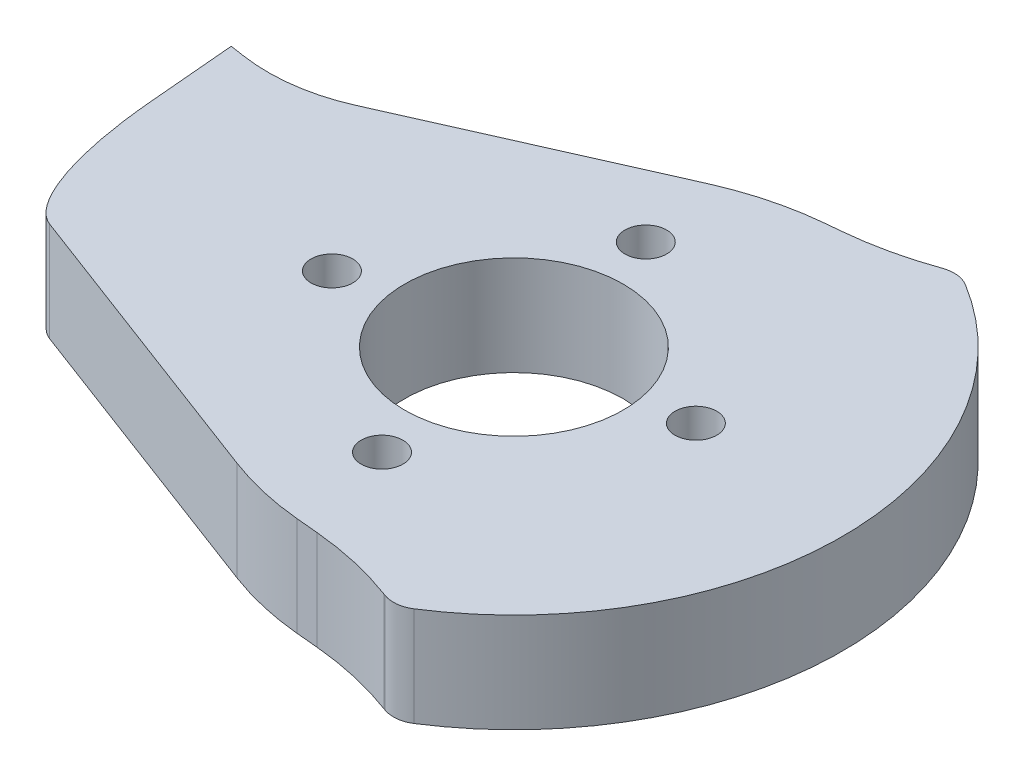
ISO-10303-21;
HEADER;
FILE_DESCRIPTION(('STEP AP214'),'2;1');
FILE_NAME('part.step','',(''),(''),'','','');
FILE_SCHEMA(('AUTOMOTIVE_DESIGN { 1 0 10303 214 1 1 1 1 }'));
ENDSEC;
DATA;
#1=APPLICATION_CONTEXT('core data for automotive mechanical design processes');
#2=APPLICATION_PROTOCOL_DEFINITION('international standard','automotive_design',2000,#1);
#3=PRODUCT_CONTEXT('',#1,'mechanical');
#4=PRODUCT('Part','Part','',(#3));
#5=PRODUCT_RELATED_PRODUCT_CATEGORY('part','',(#4));
#6=PRODUCT_DEFINITION_FORMATION('','',#4);
#7=PRODUCT_DEFINITION_CONTEXT('part definition',#1,'design');
#8=PRODUCT_DEFINITION('design','',#6,#7);
#9=PRODUCT_DEFINITION_SHAPE('','',#8);
#10=(LENGTH_UNIT() NAMED_UNIT(*) SI_UNIT(.MILLI.,.METRE.));
#11=(NAMED_UNIT(*) PLANE_ANGLE_UNIT() SI_UNIT($,.RADIAN.));
#12=(NAMED_UNIT(*) SI_UNIT($,.STERADIAN.) SOLID_ANGLE_UNIT());
#13=UNCERTAINTY_MEASURE_WITH_UNIT(LENGTH_MEASURE(1.E-05),#10,'distance_accuracy_value','');
#14=(GEOMETRIC_REPRESENTATION_CONTEXT(3) GLOBAL_UNCERTAINTY_ASSIGNED_CONTEXT((#13)) GLOBAL_UNIT_ASSIGNED_CONTEXT((#10,
#11,#12)) REPRESENTATION_CONTEXT('',''));
#15=CARTESIAN_POINT('',(0.,0.,0.));
#16=DIRECTION('',(0.,0.,1.));
#17=DIRECTION('',(1.,0.,0.));
#18=AXIS2_PLACEMENT_3D('',#15,#16,#17);
#19=CARTESIAN_POINT('',(-3.38,10.,0.39));
#20=DIRECTION('',(0.,-1.,0.));
#21=DIRECTION('',(0.,0.,-1.));
#22=AXIS2_PLACEMENT_3D('',#19,#20,#21);
#23=PLANE('',#22);
#24=CARTESIAN_POINT('',(12.42,10.,-2.13190404258369));
#25=DIRECTION('',(0.,1.,0.));
#26=DIRECTION('',(0.,0.,1.));
#27=AXIS2_PLACEMENT_3D('',#24,#25,#26);
#28=CIRCLE('',#27,2.1);
#29=CARTESIAN_POINT('',(12.42,10.,-0.0319040425836949));
#30=VERTEX_POINT('',#29);
#31=EDGE_CURVE('E423',#30,#30,#28,.T.);
#32=ORIENTED_EDGE('',*,*,#31,.F.);
#33=EDGE_LOOP('',(#32));
#34=FACE_BOUND('',#33,.T.);
#35=CARTESIAN_POINT('',(-0.858095957416307,10.,16.19));
#36=DIRECTION('',(0.,1.,0.));
#37=DIRECTION('',(0.,0.,1.));
#38=AXIS2_PLACEMENT_3D('',#35,#36,#37);
#39=CIRCLE('',#38,2.09999999999999);
#40=CARTESIAN_POINT('',(-0.858095957416307,10.,18.29));
#41=VERTEX_POINT('',#40);
#42=EDGE_CURVE('E420',#41,#41,#39,.T.);
#43=ORIENTED_EDGE('',*,*,#42,.F.);
#44=EDGE_LOOP('',(#43));
#45=FACE_BOUND('',#44,.T.);
#46=CARTESIAN_POINT('',(-19.18,10.,2.91190404258369));
#47=DIRECTION('',(0.,1.,0.));
#48=DIRECTION('',(0.,0.,1.));
#49=AXIS2_PLACEMENT_3D('',#46,#47,#48);
#50=CIRCLE('',#49,2.1);
#51=CARTESIAN_POINT('',(-19.18,10.,5.01190404258369));
#52=VERTEX_POINT('',#51);
#53=EDGE_CURVE('E414',#52,#52,#50,.T.);
#54=ORIENTED_EDGE('',*,*,#53,.F.);
#55=EDGE_LOOP('',(#54));
#56=FACE_BOUND('',#55,.T.);
#57=CARTESIAN_POINT('',(-5.90190404258369,10.,-15.41));
#58=DIRECTION('',(0.,1.,0.));
#59=DIRECTION('',(0.,0.,1.));
#60=AXIS2_PLACEMENT_3D('',#57,#58,#59);
#61=CIRCLE('',#60,2.1);
#62=CARTESIAN_POINT('',(-5.90190404258369,10.,-13.31));
#63=VERTEX_POINT('',#62);
#64=EDGE_CURVE('E408',#63,#63,#61,.T.);
#65=ORIENTED_EDGE('',*,*,#64,.F.);
#66=EDGE_LOOP('',(#65));
#67=FACE_BOUND('',#66,.T.);
#68=CARTESIAN_POINT('',(-3.38,10.,0.39));
#69=DIRECTION('',(0.,1.,0.));
#70=DIRECTION('',(0.,0.,-1.));
#71=AXIS2_PLACEMENT_3D('',#68,#69,#70);
#72=CIRCLE('',#71,33.05);
#73=CARTESIAN_POINT('',(14.4231109318557,10.,28.235138555016));
#74=VERTEX_POINT('',#73);
#75=CARTESIAN_POINT('',(13.8970744591724,10.,-27.78454876537));
#76=VERTEX_POINT('',#75);
#77=EDGE_CURVE('E671',#74,#76,#72,.T.);
#78=ORIENTED_EDGE('',*,*,#77,.T.);
#79=CARTESIAN_POINT('',(12.328807488597,10.,-25.2271010710853));
#80=DIRECTION('',(0.,-1.,0.));
#81=DIRECTION('',(0.,0.,-1.));
#82=AXIS2_PLACEMENT_3D('',#79,#80,#81);
#83=CIRCLE('',#82,3.);
#84=CARTESIAN_POINT('',(11.3159641886975,10.,-28.0509545463649));
#85=VERTEX_POINT('',#84);
#86=EDGE_CURVE('E50',#76,#85,#83,.F.);
#87=ORIENTED_EDGE('',*,*,#86,.T.);
#88=CARTESIAN_POINT('',(-0.16292654349641,10.,-60.0546272662005));
#89=DIRECTION('',(0.,-1.,0.));
#90=DIRECTION('',(0.,0.,-1.));
#91=AXIS2_PLACEMENT_3D('',#88,#89,#90);
#92=CIRCLE('',#91,34.);
#93=CARTESIAN_POINT('',(2.97875034392076,10.,-26.2000874475135));
#94=VERTEX_POINT('',#93);
#95=EDGE_CURVE('E322',#85,#94,#92,.T.);
#96=ORIENTED_EDGE('',*,*,#95,.T.);
#97=DIRECTION('',(-0.995721759373149,0.,0.0924022613946225));
#98=VECTOR('',#97,1.);
#99=CARTESIAN_POINT('',(7.39594578687549,10.,-26.61));
#100=LINE('',#99,#98);
#101=CARTESIAN_POINT('',(1.51621543901955,10.,-26.0643652627673));
#102=VERTEX_POINT('',#101);
#103=EDGE_CURVE('E675',#94,#102,#100,.T.);
#104=ORIENTED_EDGE('',*,*,#103,.T.);
#105=CARTESIAN_POINT('',(4.28828328085822,10.,3.80728751842721));
#106=DIRECTION('',(0.,-1.,0.));
#107=DIRECTION('',(0.,0.,-1.));
#108=AXIS2_PLACEMENT_3D('',#105,#106,#107);
#109=CIRCLE('',#108,30.);
#110=CARTESIAN_POINT('',(-7.87496371181006,10.,-23.6163413916085));
#111=VERTEX_POINT('',#110);
#112=EDGE_CURVE('E341',#102,#111,#109,.F.);
#113=ORIENTED_EDGE('',*,*,#112,.T.);
#114=DIRECTION('',(-0.914120963667857,0.,0.405441566422276));
#115=VECTOR('',#114,1.);
#116=CARTESIAN_POINT('',(-37.1994590555047,10.,-10.61));
#117=LINE('',#116,#115);
#118=CARTESIAN_POINT('',(-32.4057894577545,10.,-12.7361441186342));
#119=VERTEX_POINT('',#118);
#120=EDGE_CURVE('E169',#111,#119,#117,.T.);
#121=ORIENTED_EDGE('',*,*,#120,.T.);
#122=CARTESIAN_POINT('',(-39.7037376533555,10.,-29.1903214646556));
#123=DIRECTION('',(0.,-1.,0.));
#124=DIRECTION('',(0.,0.,-1.));
#125=AXIS2_PLACEMENT_3D('',#122,#123,#124);
#126=CIRCLE('',#125,18.);
#127=CARTESIAN_POINT('',(-42.3849755981748,10.,-11.3911371270726));
#128=VERTEX_POINT('',#127);
#129=EDGE_CURVE('E164',#119,#128,#126,.T.);
#130=ORIENTED_EDGE('',*,*,#129,.T.);
#131=DIRECTION('',(-0.988843574310169,0.,-0.148957663601072));
#132=VECTOR('',#131,1.);
#133=CARTESIAN_POINT('',(-43.8378793314726,10.,-11.61));
#134=LINE('',#133,#132);
#135=CARTESIAN_POINT('',(-43.8378793314726,10.,-11.61));
#136=VERTEX_POINT('',#135);
#137=EDGE_CURVE('E157',#128,#136,#134,.T.);
#138=ORIENTED_EDGE('',*,*,#137,.T.);
#139=DIRECTION('',(0.0866296163648424,0.,0.996240588195683));
#140=VECTOR('',#139,1.);
#141=CARTESIAN_POINT('',(-43.8378793314726,10.,-11.61));
#142=LINE('',#141,#140);
#143=CARTESIAN_POINT('',(-43.0686600279011,10.,-2.7639780089278));
#144=VERTEX_POINT('',#143);
#145=EDGE_CURVE('E161',#136,#144,#142,.T.);
#146=ORIENTED_EDGE('',*,*,#145,.T.);
#147=CARTESIAN_POINT('',(-37.4640468028692,10.,13.0390917535551));
#148=CARTESIAN_POINT('',(-41.8378793314726,10.,11.39));
#149=CARTESIAN_POINT('',(-43.0686600279011,10.,-2.7639780089278));
#150=(BOUNDED_CURVE() B_SPLINE_CURVE(2,(#147,#148,#149),.UNSPECIFIED.,.F.,
.F.) B_SPLINE_CURVE_WITH_KNOTS((3,3),(0.,1.),
.UNSPECIFIED.) CURVE() GEOMETRIC_REPRESENTATION_ITEM() RATIONAL_B_SPLINE_CURVE((1.,
0.84632326853336,1.)) REPRESENTATION_ITEM(''));
#151=CARTESIAN_POINT('',(-37.4640468028692,10.,13.0390917535551));
#152=VERTEX_POINT('',#151);
#153=EDGE_CURVE('E253',#144,#152,#150,.F.);
#154=ORIENTED_EDGE('',*,*,#153,.T.);
#155=DIRECTION('',(0.935701397714502,0.,0.352792990739793));
#156=VECTOR('',#155,1.);
#157=CARTESIAN_POINT('',(-41.8378793314726,10.,11.39));
#158=LINE('',#157,#156);
#159=CARTESIAN_POINT('',(-7.16448350646626,10.,24.4631139678611));
#160=VERTEX_POINT('',#159);
#161=EDGE_CURVE('E184',#152,#160,#158,.T.);
#162=ORIENTED_EDGE('',*,*,#161,.T.);
#163=CARTESIAN_POINT('',(3.41930621572751,10.,-3.60792796357394));
#164=DIRECTION('',(0.,-1.,0.));
#165=DIRECTION('',(0.,0.,-1.));
#166=AXIS2_PLACEMENT_3D('',#163,#164,#165);
#167=CIRCLE('',#166,30.);
#168=CARTESIAN_POINT('',(0.647238373888836,10.,26.2637248176205));
#169=VERTEX_POINT('',#168);
#170=EDGE_CURVE('E339',#160,#169,#167,.F.);
#171=ORIENTED_EDGE('',*,*,#170,.T.);
#172=DIRECTION('',(0.995721759373149,0.,0.0924022613946225));
#173=VECTOR('',#172,1.);
#174=CARTESIAN_POINT('',(-3.38,10.,25.89));
#175=LINE('',#174,#173);
#176=CARTESIAN_POINT('',(2.88878217623837,10.,26.4717384664159));
#177=VERTEX_POINT('',#176);
#178=EDGE_CURVE('E187',#169,#177,#175,.T.);
#179=ORIENTED_EDGE('',*,*,#178,.T.);
#180=CARTESIAN_POINT('',(-0.2528947111788,10.,60.326278285103));
#181=DIRECTION('',(0.,-1.,0.));
#182=DIRECTION('',(0.,0.,-1.));
#183=AXIS2_PLACEMENT_3D('',#180,#181,#182);
#184=CIRCLE('',#183,34.);
#185=CARTESIAN_POINT('',(11.6366885483879,10.,28.4728984029958));
#186=VERTEX_POINT('',#185);
#187=EDGE_CURVE('E318',#177,#186,#184,.T.);
#188=ORIENTED_EDGE('',*,*,#187,.T.);
#189=DIRECTION('',(0.936864114179623,0.,0.349693625281374));
#190=VECTOR('',#189,1.);
#191=CARTESIAN_POINT('',(7.39594578687549,10.,26.89));
#192=LINE('',#191,#190);
#193=CARTESIAN_POINT('',(11.758013935117,10.,28.5181842813658));
#194=VERTEX_POINT('',#193);
#195=EDGE_CURVE('E688',#186,#194,#192,.T.);
#196=ORIENTED_EDGE('',*,*,#195,.T.);
#197=CARTESIAN_POINT('',(12.8070948109611,10.,25.707591938827));
#198=DIRECTION('',(0.,-1.,0.));
#199=DIRECTION('',(0.,0.,-1.));
#200=AXIS2_PLACEMENT_3D('',#197,#198,#199);
#201=CIRCLE('',#200,3.);
#202=EDGE_CURVE('E306',#194,#74,#201,.F.);
#203=ORIENTED_EDGE('',*,*,#202,.T.);
#204=EDGE_LOOP('',(#78,#87,#96,#104,#113,#121,#130,#138,#146,#154,#162,#171,#179,#188,#196,#203));
#205=FACE_BOUND('',#204,.T.);
#206=CARTESIAN_POINT('',(-3.38,10.,0.39));
#207=DIRECTION('',(0.,1.,0.));
#208=DIRECTION('',(0.,0.,1.));
#209=AXIS2_PLACEMENT_3D('',#206,#207,#208);
#210=CIRCLE('',#209,11.);
#211=CARTESIAN_POINT('',(-3.38,10.,11.39));
#212=VERTEX_POINT('',#211);
#213=EDGE_CURVE('E398',#212,#212,#210,.T.);
#214=ORIENTED_EDGE('',*,*,#213,.F.);
#215=EDGE_LOOP('',(#214));
#216=FACE_BOUND('',#215,.T.);
#217=ADVANCED_FACE('F42',(#34,#45,#56,#67,#205,#216),#23,.F.);
#218=CARTESIAN_POINT('',(-3.38,0.,0.39));
#219=DIRECTION('',(0.,-1.,0.));
#220=DIRECTION('',(0.,0.,-1.));
#221=AXIS2_PLACEMENT_3D('',#218,#219,#220);
#222=PLANE('',#221);
#223=CARTESIAN_POINT('',(12.42,0.,-2.13190404258369));
#224=DIRECTION('',(0.,1.,0.));
#225=DIRECTION('',(0.,0.,1.));
#226=AXIS2_PLACEMENT_3D('',#223,#224,#225);
#227=CIRCLE('',#226,2.1);
#228=CARTESIAN_POINT('',(12.42,0.,-0.0319040425836949));
#229=VERTEX_POINT('',#228);
#230=EDGE_CURVE('E403',#229,#229,#227,.T.);
#231=ORIENTED_EDGE('',*,*,#230,.T.);
#232=EDGE_LOOP('',(#231));
#233=FACE_BOUND('',#232,.T.);
#234=CARTESIAN_POINT('',(-0.858095957416307,0.,16.19));
#235=DIRECTION('',(0.,1.,0.));
#236=DIRECTION('',(0.,0.,1.));
#237=AXIS2_PLACEMENT_3D('',#234,#235,#236);
#238=CIRCLE('',#237,2.09999999999999);
#239=CARTESIAN_POINT('',(-0.858095957416307,0.,18.29));
#240=VERTEX_POINT('',#239);
#241=EDGE_CURVE('E417',#240,#240,#238,.T.);
#242=ORIENTED_EDGE('',*,*,#241,.T.);
#243=EDGE_LOOP('',(#242));
#244=FACE_BOUND('',#243,.T.);
#245=CARTESIAN_POINT('',(-19.18,0.,2.91190404258369));
#246=DIRECTION('',(0.,1.,0.));
#247=DIRECTION('',(0.,0.,1.));
#248=AXIS2_PLACEMENT_3D('',#245,#246,#247);
#249=CIRCLE('',#248,2.1);
#250=CARTESIAN_POINT('',(-19.18,0.,5.01190404258369));
#251=VERTEX_POINT('',#250);
#252=EDGE_CURVE('E411',#251,#251,#249,.T.);
#253=ORIENTED_EDGE('',*,*,#252,.T.);
#254=EDGE_LOOP('',(#253));
#255=FACE_BOUND('',#254,.T.);
#256=CARTESIAN_POINT('',(-5.90190404258369,0.,-15.41));
#257=DIRECTION('',(0.,1.,0.));
#258=DIRECTION('',(0.,0.,1.));
#259=AXIS2_PLACEMENT_3D('',#256,#257,#258);
#260=CIRCLE('',#259,2.1);
#261=CARTESIAN_POINT('',(-5.90190404258369,0.,-13.31));
#262=VERTEX_POINT('',#261);
#263=EDGE_CURVE('E405',#262,#262,#260,.T.);
#264=ORIENTED_EDGE('',*,*,#263,.T.);
#265=EDGE_LOOP('',(#264));
#266=FACE_BOUND('',#265,.T.);
#267=CARTESIAN_POINT('',(-0.16292654349641,0.,-60.0546272662005));
#268=DIRECTION('',(0.,-1.,0.));
#269=DIRECTION('',(0.,0.,-1.));
#270=AXIS2_PLACEMENT_3D('',#267,#268,#269);
#271=CIRCLE('',#270,34.);
#272=CARTESIAN_POINT('',(2.97875034392076,0.,-26.2000874475135));
#273=VERTEX_POINT('',#272);
#274=CARTESIAN_POINT('',(11.3159641886975,0.,-28.0509545463649));
#275=VERTEX_POINT('',#274);
#276=EDGE_CURVE('E324',#273,#275,#271,.F.);
#277=ORIENTED_EDGE('',*,*,#276,.T.);
#278=CARTESIAN_POINT('',(12.328807488597,0.,-25.2271010710853));
#279=DIRECTION('',(0.,-1.,0.));
#280=DIRECTION('',(0.,0.,-1.));
#281=AXIS2_PLACEMENT_3D('',#278,#279,#280);
#282=CIRCLE('',#281,3.);
#283=CARTESIAN_POINT('',(13.8970744591724,0.,-27.78454876537));
#284=VERTEX_POINT('',#283);
#285=EDGE_CURVE('E312',#275,#284,#282,.T.);
#286=ORIENTED_EDGE('',*,*,#285,.T.);
#287=CARTESIAN_POINT('',(-3.38,0.,0.39));
#288=DIRECTION('',(0.,1.,0.));
#289=DIRECTION('',(0.,0.,-1.));
#290=AXIS2_PLACEMENT_3D('',#287,#288,#289);
#291=CIRCLE('',#290,33.05);
#292=CARTESIAN_POINT('',(14.4231109318557,0.,28.235138555016));
#293=VERTEX_POINT('',#292);
#294=EDGE_CURVE('E298',#293,#284,#291,.T.);
#295=ORIENTED_EDGE('',*,*,#294,.F.);
#296=CARTESIAN_POINT('',(12.8070948109611,0.,25.707591938827));
#297=DIRECTION('',(0.,-1.,0.));
#298=DIRECTION('',(0.,0.,-1.));
#299=AXIS2_PLACEMENT_3D('',#296,#297,#298);
#300=CIRCLE('',#299,3.);
#301=CARTESIAN_POINT('',(11.758013935117,0.,28.5181842813658));
#302=VERTEX_POINT('',#301);
#303=EDGE_CURVE('E304',#293,#302,#300,.T.);
#304=ORIENTED_EDGE('',*,*,#303,.T.);
#305=DIRECTION('',(0.936864114179623,0.,0.349693625281374));
#306=VECTOR('',#305,1.);
#307=CARTESIAN_POINT('',(7.39594578687549,0.,26.89));
#308=LINE('',#307,#306);
#309=CARTESIAN_POINT('',(11.6366885483879,0.,28.4728984029958));
#310=VERTEX_POINT('',#309);
#311=EDGE_CURVE('E294',#310,#302,#308,.T.);
#312=ORIENTED_EDGE('',*,*,#311,.F.);
#313=CARTESIAN_POINT('',(-0.2528947111788,0.,60.326278285103));
#314=DIRECTION('',(0.,-1.,0.));
#315=DIRECTION('',(0.,0.,-1.));
#316=AXIS2_PLACEMENT_3D('',#313,#314,#315);
#317=CIRCLE('',#316,34.);
#318=CARTESIAN_POINT('',(2.88878217623837,0.,26.4717384664159));
#319=VERTEX_POINT('',#318);
#320=EDGE_CURVE('E320',#310,#319,#317,.F.);
#321=ORIENTED_EDGE('',*,*,#320,.T.);
#322=DIRECTION('',(0.995721759373149,0.,0.0924022613946225));
#323=VECTOR('',#322,1.);
#324=CARTESIAN_POINT('',(-3.38,0.,25.89));
#325=LINE('',#324,#323);
#326=CARTESIAN_POINT('',(0.647238373888836,0.,26.2637248176205));
#327=VERTEX_POINT('',#326);
#328=EDGE_CURVE('E299',#327,#319,#325,.T.);
#329=ORIENTED_EDGE('',*,*,#328,.F.);
#330=CARTESIAN_POINT('',(3.41930621572751,0.,-3.60792796357394));
#331=DIRECTION('',(0.,-1.,0.));
#332=DIRECTION('',(0.,0.,-1.));
#333=AXIS2_PLACEMENT_3D('',#330,#331,#332);
#334=CIRCLE('',#333,30.);
#335=CARTESIAN_POINT('',(-7.16448350646626,0.,24.4631139678611));
#336=VERTEX_POINT('',#335);
#337=EDGE_CURVE('E345',#327,#336,#334,.T.);
#338=ORIENTED_EDGE('',*,*,#337,.T.);
#339=DIRECTION('',(0.935701397714502,0.,0.352792990739793));
#340=VECTOR('',#339,1.);
#341=CARTESIAN_POINT('',(-41.8378793314726,0.,11.39));
#342=LINE('',#341,#340);
#343=CARTESIAN_POINT('',(-37.4640468028692,0.,13.0390917535551));
#344=VERTEX_POINT('',#343);
#345=EDGE_CURVE('E208',#344,#336,#342,.T.);
#346=ORIENTED_EDGE('',*,*,#345,.F.);
#347=CARTESIAN_POINT('',(-43.0686600279011,0.,-2.7639780089278));
#348=CARTESIAN_POINT('',(-41.8378793314726,0.,11.39));
#349=CARTESIAN_POINT('',(-37.4640468028692,0.,13.0390917535551));
#350=(BOUNDED_CURVE() B_SPLINE_CURVE(2,(#347,#348,#349),.UNSPECIFIED.,.F.,
.F.) B_SPLINE_CURVE_WITH_KNOTS((3,3),(0.,1.),
.UNSPECIFIED.) CURVE() GEOMETRIC_REPRESENTATION_ITEM() RATIONAL_B_SPLINE_CURVE((1.,
0.84632326853336,1.)) REPRESENTATION_ITEM(''));
#351=CARTESIAN_POINT('',(-43.0686600279011,0.,-2.7639780089278));
#352=VERTEX_POINT('',#351);
#353=EDGE_CURVE('E396',#344,#352,#350,.F.);
#354=ORIENTED_EDGE('',*,*,#353,.T.);
#355=DIRECTION('',(0.0866296163648424,0.,0.996240588195683));
#356=VECTOR('',#355,1.);
#357=CARTESIAN_POINT('',(-43.8378793314726,0.,-11.61));
#358=LINE('',#357,#356);
#359=CARTESIAN_POINT('',(-43.8378793314726,0.,-11.61));
#360=VERTEX_POINT('',#359);
#361=EDGE_CURVE('E221',#360,#352,#358,.T.);
#362=ORIENTED_EDGE('',*,*,#361,.F.);
#363=DIRECTION('',(-0.988843574310169,0.,-0.148957663601072));
#364=VECTOR('',#363,1.);
#365=CARTESIAN_POINT('',(-43.8378793314726,0.,-11.61));
#366=LINE('',#365,#364);
#367=CARTESIAN_POINT('',(-42.3849755981748,0.,-11.3911371270726));
#368=VERTEX_POINT('',#367);
#369=EDGE_CURVE('E174',#368,#360,#366,.T.);
#370=ORIENTED_EDGE('',*,*,#369,.F.);
#371=CARTESIAN_POINT('',(-39.7037376533555,0.,-29.1903214646556));
#372=DIRECTION('',(0.,-1.,0.));
#373=DIRECTION('',(0.,0.,-1.));
#374=AXIS2_PLACEMENT_3D('',#371,#372,#373);
#375=CIRCLE('',#374,18.);
#376=CARTESIAN_POINT('',(-32.4057894577545,0.,-12.7361441186342));
#377=VERTEX_POINT('',#376);
#378=EDGE_CURVE('E354',#368,#377,#375,.F.);
#379=ORIENTED_EDGE('',*,*,#378,.T.);
#380=DIRECTION('',(-0.914120963667857,0.,0.405441566422276));
#381=VECTOR('',#380,1.);
#382=CARTESIAN_POINT('',(-37.1994590555047,0.,-10.61));
#383=LINE('',#382,#381);
#384=CARTESIAN_POINT('',(-7.87496371181006,0.,-23.6163413916085));
#385=VERTEX_POINT('',#384);
#386=EDGE_CURVE('E189',#385,#377,#383,.T.);
#387=ORIENTED_EDGE('',*,*,#386,.F.);
#388=CARTESIAN_POINT('',(4.28828328085822,0.,3.80728751842721));
#389=DIRECTION('',(0.,-1.,0.));
#390=DIRECTION('',(0.,0.,-1.));
#391=AXIS2_PLACEMENT_3D('',#388,#389,#390);
#392=CIRCLE('',#391,30.);
#393=CARTESIAN_POINT('',(1.51621543901955,0.,-26.0643652627673));
#394=VERTEX_POINT('',#393);
#395=EDGE_CURVE('E347',#385,#394,#392,.T.);
#396=ORIENTED_EDGE('',*,*,#395,.T.);
#397=DIRECTION('',(-0.995721759373149,0.,0.0924022613946225));
#398=VECTOR('',#397,1.);
#399=CARTESIAN_POINT('',(7.39594578687549,0.,-26.61));
#400=LINE('',#399,#398);
#401=EDGE_CURVE('E674',#273,#394,#400,.T.);
#402=ORIENTED_EDGE('',*,*,#401,.F.);
#403=EDGE_LOOP('',(#277,#286,#295,#304,#312,#321,#329,#338,#346,#354,#362,#370,#379,#387,#396,#402));
#404=FACE_BOUND('',#403,.T.);
#405=CARTESIAN_POINT('',(-3.38,0.,0.39));
#406=DIRECTION('',(0.,1.,0.));
#407=DIRECTION('',(0.,0.,1.));
#408=AXIS2_PLACEMENT_3D('',#405,#406,#407);
#409=CIRCLE('',#408,11.);
#410=CARTESIAN_POINT('',(-3.38,0.,11.39));
#411=VERTEX_POINT('',#410);
#412=EDGE_CURVE('E201',#411,#411,#409,.T.);
#413=ORIENTED_EDGE('',*,*,#412,.T.);
#414=EDGE_LOOP('',(#413));
#415=FACE_BOUND('',#414,.T.);
#416=ADVANCED_FACE('F237',(#233,#244,#255,#266,#404,#415),#222,.T.);
#417=CARTESIAN_POINT('',(-43.8378793314726,10.,-11.61));
#418=DIRECTION('',(0.996240588195683,0.,-0.0866296163648424));
#419=DIRECTION('',(-0.0866296163648424,0.,-0.996240588195683));
#420=AXIS2_PLACEMENT_3D('',#417,#418,#419);
#421=PLANE('',#420);
#422=ORIENTED_EDGE('',*,*,#361,.T.);
#423=CARTESIAN_POINT('',(-43.0686600279011,10.5,-2.7639780089278));
#424=CARTESIAN_POINT('',(-43.0686600279011,6.83333333333332,-2.7639780089278));
#425=CARTESIAN_POINT('',(-43.0686600279011,3.16666666666667,-2.7639780089278));
#426=CARTESIAN_POINT('',(-43.0686600279011,-0.5,-2.7639780089278));
#427=(BOUNDED_CURVE() B_SPLINE_CURVE(3,(#423,#424,#425,#426),.UNSPECIFIED.,.F.,
.F.) B_SPLINE_CURVE_WITH_KNOTS((4,4),(-0.0005,0.0105),
.UNSPECIFIED.) CURVE() GEOMETRIC_REPRESENTATION_ITEM() RATIONAL_B_SPLINE_CURVE((1.,1.,1.,1.)) REPRESENTATION_ITEM(''));
#428=EDGE_CURVE('E182',#352,#144,#427,.F.);
#429=ORIENTED_EDGE('',*,*,#428,.T.);
#430=ORIENTED_EDGE('',*,*,#145,.F.);
#431=DIRECTION('',(0.,-1.,0.));
#432=VECTOR('',#431,1.);
#433=CARTESIAN_POINT('',(-43.8378793314726,10.,-11.61));
#434=LINE('',#433,#432);
#435=EDGE_CURVE('E168',#136,#360,#434,.T.);
#436=ORIENTED_EDGE('',*,*,#435,.T.);
#437=EDGE_LOOP('',(#422,#429,#430,#436));
#438=FACE_BOUND('',#437,.T.);
#439=ADVANCED_FACE('F180',(#438),#421,.F.);
#440=CARTESIAN_POINT('',(-41.8378793314726,10.,11.39));
#441=DIRECTION('',(0.352792990739793,0.,-0.935701397714502));
#442=DIRECTION('',(-0.935701397714502,0.,-0.352792990739793));
#443=AXIS2_PLACEMENT_3D('',#440,#441,#442);
#444=PLANE('',#443);
#445=ORIENTED_EDGE('',*,*,#345,.T.);
#446=DIRECTION('',(0.,-1.,0.));
#447=VECTOR('',#446,1.);
#448=CARTESIAN_POINT('',(-7.16448350646626,10.,24.4631139678611));
#449=LINE('',#448,#447);
#450=EDGE_CURVE('E343',#336,#160,#449,.F.);
#451=ORIENTED_EDGE('',*,*,#450,.T.);
#452=ORIENTED_EDGE('',*,*,#161,.F.);
#453=CARTESIAN_POINT('',(-37.4640468028692,-0.5,13.0390917535551));
#454=CARTESIAN_POINT('',(-37.4640468028692,3.16666666666667,13.0390917535551));
#455=CARTESIAN_POINT('',(-37.4640468028692,6.83333333333332,13.0390917535551));
#456=CARTESIAN_POINT('',(-37.4640468028692,10.5,13.0390917535551));
#457=(BOUNDED_CURVE() B_SPLINE_CURVE(3,(#453,#454,#455,#456),.UNSPECIFIED.,.F.,
.F.) B_SPLINE_CURVE_WITH_KNOTS((4,4),(-0.0005,0.0105),
.UNSPECIFIED.) CURVE() GEOMETRIC_REPRESENTATION_ITEM() RATIONAL_B_SPLINE_CURVE((1.,1.,1.,1.)) REPRESENTATION_ITEM(''));
#458=EDGE_CURVE('E178',#152,#344,#457,.F.);
#459=ORIENTED_EDGE('',*,*,#458,.T.);
#460=EDGE_LOOP('',(#445,#451,#452,#459));
#461=FACE_BOUND('',#460,.T.);
#462=ADVANCED_FACE('F223',(#461),#444,.F.);
#463=CARTESIAN_POINT('',(-3.38,10.,25.89));
#464=DIRECTION('',(0.0924022613946225,0.,-0.995721759373149));
#465=DIRECTION('',(-0.995721759373149,0.,-0.0924022613946225));
#466=AXIS2_PLACEMENT_3D('',#463,#464,#465);
#467=PLANE('',#466);
#468=ORIENTED_EDGE('',*,*,#328,.T.);
#469=DIRECTION('',(0.,-1.,0.));
#470=VECTOR('',#469,1.);
#471=CARTESIAN_POINT('',(2.88878217623837,10.,26.4717384664159));
#472=LINE('',#471,#470);
#473=EDGE_CURVE('E327',#319,#177,#472,.F.);
#474=ORIENTED_EDGE('',*,*,#473,.T.);
#475=ORIENTED_EDGE('',*,*,#178,.F.);
#476=DIRECTION('',(0.,-1.,0.));
#477=VECTOR('',#476,1.);
#478=CARTESIAN_POINT('',(0.647238373888836,10.,26.2637248176205));
#479=LINE('',#478,#477);
#480=EDGE_CURVE('E350',#169,#327,#479,.T.);
#481=ORIENTED_EDGE('',*,*,#480,.T.);
#482=EDGE_LOOP('',(#468,#474,#475,#481));
#483=FACE_BOUND('',#482,.T.);
#484=ADVANCED_FACE('F233',(#483),#467,.F.);
#485=CARTESIAN_POINT('',(7.39594578687549,10.,26.89));
#486=DIRECTION('',(0.349693625281374,0.,-0.936864114179623));
#487=DIRECTION('',(-0.936864114179623,0.,-0.349693625281374));
#488=AXIS2_PLACEMENT_3D('',#485,#486,#487);
#489=PLANE('',#488);
#490=ORIENTED_EDGE('',*,*,#311,.T.);
#491=DIRECTION('',(0.,-1.,0.));
#492=VECTOR('',#491,1.);
#493=CARTESIAN_POINT('',(11.758013935117,10.,28.5181842813658));
#494=LINE('',#493,#492);
#495=EDGE_CURVE('E12',#302,#194,#494,.F.);
#496=ORIENTED_EDGE('',*,*,#495,.T.);
#497=ORIENTED_EDGE('',*,*,#195,.F.);
#498=DIRECTION('',(0.,-1.,0.));
#499=VECTOR('',#498,1.);
#500=CARTESIAN_POINT('',(11.6366885483879,0.,28.4728984029958));
#501=LINE('',#500,#499);
#502=EDGE_CURVE('E296',#186,#310,#501,.T.);
#503=ORIENTED_EDGE('',*,*,#502,.T.);
#504=EDGE_LOOP('',(#490,#496,#497,#503));
#505=FACE_BOUND('',#504,.T.);
#506=ADVANCED_FACE('F286',(#505),#489,.F.);
#507=CARTESIAN_POINT('',(-3.38,10.,0.39));
#508=DIRECTION('',(0.,-1.,0.));
#509=DIRECTION('',(0.,0.,-1.));
#510=AXIS2_PLACEMENT_3D('',#507,#508,#509);
#511=CYLINDRICAL_SURFACE('',#510,33.05);
#512=ORIENTED_EDGE('',*,*,#294,.T.);
#513=DIRECTION('',(0.,-1.,0.));
#514=VECTOR('',#513,1.);
#515=CARTESIAN_POINT('',(13.8970744591724,10.,-27.78454876537));
#516=LINE('',#515,#514);
#517=EDGE_CURVE('E63',#284,#76,#516,.F.);
#518=ORIENTED_EDGE('',*,*,#517,.T.);
#519=ORIENTED_EDGE('',*,*,#77,.F.);
#520=DIRECTION('',(0.,-1.,0.));
#521=VECTOR('',#520,1.);
#522=CARTESIAN_POINT('',(14.4231109318557,10.,28.235138555016));
#523=LINE('',#522,#521);
#524=EDGE_CURVE('E307',#74,#293,#523,.T.);
#525=ORIENTED_EDGE('',*,*,#524,.T.);
#526=EDGE_LOOP('',(#512,#518,#519,#525));
#527=FACE_BOUND('',#526,.T.);
#528=ADVANCED_FACE('F283',(#527),#511,.T.);
#529=CARTESIAN_POINT('',(7.39594578687549,10.,-26.61));
#530=DIRECTION('',(0.0924022613946225,0.,0.995721759373149));
#531=DIRECTION('',(0.995721759373149,0.,-0.0924022613946225));
#532=AXIS2_PLACEMENT_3D('',#529,#530,#531);
#533=PLANE('',#532);
#534=ORIENTED_EDGE('',*,*,#103,.F.);
#535=DIRECTION('',(0.,-1.,0.));
#536=VECTOR('',#535,1.);
#537=CARTESIAN_POINT('',(2.97875034392076,0.,-26.2000874475135));
#538=LINE('',#537,#536);
#539=EDGE_CURVE('E330',#94,#273,#538,.T.);
#540=ORIENTED_EDGE('',*,*,#539,.T.);
#541=ORIENTED_EDGE('',*,*,#401,.T.);
#542=DIRECTION('',(0.,-1.,0.));
#543=VECTOR('',#542,1.);
#544=CARTESIAN_POINT('',(1.51621543901955,10.,-26.0643652627673));
#545=LINE('',#544,#543);
#546=EDGE_CURVE('E333',#394,#102,#545,.F.);
#547=ORIENTED_EDGE('',*,*,#546,.T.);
#548=EDGE_LOOP('',(#534,#540,#541,#547));
#549=FACE_BOUND('',#548,.T.);
#550=ADVANCED_FACE('F279',(#549),#533,.F.);
#551=CARTESIAN_POINT('',(-37.1994590555047,10.,-10.61));
#552=DIRECTION('',(0.405441566422276,0.,0.914120963667857));
#553=DIRECTION('',(0.914120963667857,0.,-0.405441566422276));
#554=AXIS2_PLACEMENT_3D('',#551,#552,#553);
#555=PLANE('',#554);
#556=ORIENTED_EDGE('',*,*,#120,.F.);
#557=DIRECTION('',(0.,-1.,0.));
#558=VECTOR('',#557,1.);
#559=CARTESIAN_POINT('',(-7.87496371181006,10.,-23.6163413916085));
#560=LINE('',#559,#558);
#561=EDGE_CURVE('E336',#111,#385,#560,.T.);
#562=ORIENTED_EDGE('',*,*,#561,.T.);
#563=ORIENTED_EDGE('',*,*,#386,.T.);
#564=DIRECTION('',(0.,-1.,0.));
#565=VECTOR('',#564,1.);
#566=CARTESIAN_POINT('',(-32.4057894577545,10.,-12.7361441186342));
#567=LINE('',#566,#565);
#568=EDGE_CURVE('E357',#377,#119,#567,.F.);
#569=ORIENTED_EDGE('',*,*,#568,.T.);
#570=EDGE_LOOP('',(#556,#562,#563,#569));
#571=FACE_BOUND('',#570,.T.);
#572=ADVANCED_FACE('F276',(#571),#555,.F.);
#573=CARTESIAN_POINT('',(-43.8378793314726,10.,-11.61));
#574=DIRECTION('',(-0.148957663601072,0.,0.988843574310169));
#575=DIRECTION('',(0.988843574310169,0.,0.148957663601072));
#576=AXIS2_PLACEMENT_3D('',#573,#574,#575);
#577=PLANE('',#576);
#578=ORIENTED_EDGE('',*,*,#137,.F.);
#579=DIRECTION('',(0.,-1.,0.));
#580=VECTOR('',#579,1.);
#581=CARTESIAN_POINT('',(-42.3849755981748,0.,-11.3911371270726));
#582=LINE('',#581,#580);
#583=EDGE_CURVE('E360',#128,#368,#582,.T.);
#584=ORIENTED_EDGE('',*,*,#583,.T.);
#585=ORIENTED_EDGE('',*,*,#369,.T.);
#586=ORIENTED_EDGE('',*,*,#435,.F.);
#587=EDGE_LOOP('',(#578,#584,#585,#586));
#588=FACE_BOUND('',#587,.T.);
#589=ADVANCED_FACE('F172',(#588),#577,.F.);
#590=CARTESIAN_POINT('',(-3.38,10.,0.39));
#591=DIRECTION('',(0.,-1.,0.));
#592=DIRECTION('',(0.,0.,-1.));
#593=AXIS2_PLACEMENT_3D('',#590,#591,#592);
#594=CYLINDRICAL_SURFACE('',#593,11.);
#595=ORIENTED_EDGE('',*,*,#213,.T.);
#596=EDGE_LOOP('',(#595));
#597=FACE_BOUND('',#596,.T.);
#598=ORIENTED_EDGE('',*,*,#412,.F.);
#599=EDGE_LOOP('',(#598));
#600=FACE_BOUND('',#599,.T.);
#601=ADVANCED_FACE('F268',(#597,#600),#594,.F.);
#602=CARTESIAN_POINT('',(-5.90190404258369,0.,-15.41));
#603=DIRECTION('',(0.,1.,0.));
#604=DIRECTION('',(0.,0.,1.));
#605=AXIS2_PLACEMENT_3D('',#602,#603,#604);
#606=CYLINDRICAL_SURFACE('',#605,2.1);
#607=ORIENTED_EDGE('',*,*,#263,.F.);
#608=EDGE_LOOP('',(#607));
#609=FACE_BOUND('',#608,.T.);
#610=ORIENTED_EDGE('',*,*,#64,.T.);
#611=EDGE_LOOP('',(#610));
#612=FACE_BOUND('',#611,.T.);
#613=ADVANCED_FACE('F443',(#609,#612),#606,.F.);
#614=CARTESIAN_POINT('',(-19.18,0.,2.91190404258369));
#615=DIRECTION('',(0.,1.,0.));
#616=DIRECTION('',(0.,0.,1.));
#617=AXIS2_PLACEMENT_3D('',#614,#615,#616);
#618=CYLINDRICAL_SURFACE('',#617,2.1);
#619=ORIENTED_EDGE('',*,*,#252,.F.);
#620=EDGE_LOOP('',(#619));
#621=FACE_BOUND('',#620,.T.);
#622=ORIENTED_EDGE('',*,*,#53,.T.);
#623=EDGE_LOOP('',(#622));
#624=FACE_BOUND('',#623,.T.);
#625=ADVANCED_FACE('F445',(#621,#624),#618,.F.);
#626=CARTESIAN_POINT('',(-0.858095957416307,0.,16.19));
#627=DIRECTION('',(0.,1.,0.));
#628=DIRECTION('',(0.,0.,1.));
#629=AXIS2_PLACEMENT_3D('',#626,#627,#628);
#630=CYLINDRICAL_SURFACE('',#629,2.09999999999999);
#631=ORIENTED_EDGE('',*,*,#241,.F.);
#632=EDGE_LOOP('',(#631));
#633=FACE_BOUND('',#632,.T.);
#634=ORIENTED_EDGE('',*,*,#42,.T.);
#635=EDGE_LOOP('',(#634));
#636=FACE_BOUND('',#635,.T.);
#637=ADVANCED_FACE('F433',(#633,#636),#630,.F.);
#638=CARTESIAN_POINT('',(12.42,0.,-2.13190404258369));
#639=DIRECTION('',(0.,1.,0.));
#640=DIRECTION('',(0.,0.,1.));
#641=AXIS2_PLACEMENT_3D('',#638,#639,#640);
#642=CYLINDRICAL_SURFACE('',#641,2.1);
#643=ORIENTED_EDGE('',*,*,#230,.F.);
#644=EDGE_LOOP('',(#643));
#645=FACE_BOUND('',#644,.T.);
#646=ORIENTED_EDGE('',*,*,#31,.T.);
#647=EDGE_LOOP('',(#646));
#648=FACE_BOUND('',#647,.T.);
#649=ADVANCED_FACE('F430',(#645,#648),#642,.F.);
#650=CARTESIAN_POINT('',(-37.4640468028692,10.5,13.0390917535551));
#651=CARTESIAN_POINT('',(-37.4640468028692,6.83333333333332,13.0390917535551));
#652=CARTESIAN_POINT('',(-37.4640468028692,3.16666666666667,13.0390917535551));
#653=CARTESIAN_POINT('',(-37.4640468028692,-0.5,13.0390917535551));
#654=CARTESIAN_POINT('',(-41.8378793314726,10.5,11.39));
#655=CARTESIAN_POINT('',(-41.8378793314726,6.83333333333332,11.39));
#656=CARTESIAN_POINT('',(-41.8378793314726,3.16666666666667,11.39));
#657=CARTESIAN_POINT('',(-41.8378793314726,-0.5,11.39));
#658=CARTESIAN_POINT('',(-43.0686600279011,10.5,-2.7639780089278));
#659=CARTESIAN_POINT('',(-43.0686600279011,6.83333333333332,-2.7639780089278));
#660=CARTESIAN_POINT('',(-43.0686600279011,3.16666666666667,-2.7639780089278));
#661=CARTESIAN_POINT('',(-43.0686600279011,-0.5,-2.7639780089278));
#662=(BOUNDED_SURFACE() B_SPLINE_SURFACE(2,3,((#650,#651,#652,#653),(#654,#655,#656,#657),(#658,
#659,#660,#661)),.UNSPECIFIED.,.F.,.F.,.F.) B_SPLINE_SURFACE_WITH_KNOTS((3,3),(4,4),(0.,1.),
(-0.0005,0.0105),.UNSPECIFIED.) GEOMETRIC_REPRESENTATION_ITEM() RATIONAL_B_SPLINE_SURFACE(((1.,
1.,1.,1.),(0.84632326853336,0.84632326853336,0.84632326853336,0.84632326853336),(1.,1.,1.,1.))) REPRESENTATION_ITEM('') SURFACE());
#663=ORIENTED_EDGE('',*,*,#153,.F.);
#664=ORIENTED_EDGE('',*,*,#428,.F.);
#665=ORIENTED_EDGE('',*,*,#353,.F.);
#666=ORIENTED_EDGE('',*,*,#458,.F.);
#667=EDGE_LOOP('',(#663,#664,#665,#666));
#668=FACE_BOUND('',#667,.T.);
#669=ADVANCED_FACE('F239',(#668),#662,.T.);
#670=CARTESIAN_POINT('',(-39.7037376533555,10.,-29.1903214646556));
#671=DIRECTION('',(0.,1.,0.));
#672=DIRECTION('',(0.,0.,1.));
#673=AXIS2_PLACEMENT_3D('',#670,#671,#672);
#674=CYLINDRICAL_SURFACE('',#673,18.);
#675=ORIENTED_EDGE('',*,*,#129,.F.);
#676=ORIENTED_EDGE('',*,*,#568,.F.);
#677=ORIENTED_EDGE('',*,*,#378,.F.);
#678=ORIENTED_EDGE('',*,*,#583,.F.);
#679=EDGE_LOOP('',(#675,#676,#677,#678));
#680=FACE_BOUND('',#679,.T.);
#681=ADVANCED_FACE('F478',(#680),#674,.F.);
#682=CARTESIAN_POINT('',(3.41930621572751,10.,-3.60792796357394));
#683=DIRECTION('',(0.,-1.,0.));
#684=DIRECTION('',(0.,0.,-1.));
#685=AXIS2_PLACEMENT_3D('',#682,#683,#684);
#686=CYLINDRICAL_SURFACE('',#685,30.);
#687=ORIENTED_EDGE('',*,*,#170,.F.);
#688=ORIENTED_EDGE('',*,*,#450,.F.);
#689=ORIENTED_EDGE('',*,*,#337,.F.);
#690=ORIENTED_EDGE('',*,*,#480,.F.);
#691=EDGE_LOOP('',(#687,#688,#689,#690));
#692=FACE_BOUND('',#691,.T.);
#693=ADVANCED_FACE('F485',(#692),#686,.T.);
#694=CARTESIAN_POINT('',(4.28828328085822,10.,3.80728751842721));
#695=DIRECTION('',(0.,-1.,0.));
#696=DIRECTION('',(0.,0.,-1.));
#697=AXIS2_PLACEMENT_3D('',#694,#695,#696);
#698=CYLINDRICAL_SURFACE('',#697,30.);
#699=ORIENTED_EDGE('',*,*,#112,.F.);
#700=ORIENTED_EDGE('',*,*,#546,.F.);
#701=ORIENTED_EDGE('',*,*,#395,.F.);
#702=ORIENTED_EDGE('',*,*,#561,.F.);
#703=EDGE_LOOP('',(#699,#700,#701,#702));
#704=FACE_BOUND('',#703,.T.);
#705=ADVANCED_FACE('F493',(#704),#698,.T.);
#706=CARTESIAN_POINT('',(-0.16292654349641,10.,-60.0546272662005));
#707=DIRECTION('',(0.,1.,0.));
#708=DIRECTION('',(0.,0.,1.));
#709=AXIS2_PLACEMENT_3D('',#706,#707,#708);
#710=CYLINDRICAL_SURFACE('',#709,34.);
#711=ORIENTED_EDGE('',*,*,#95,.F.);
#712=DIRECTION('',(0.,1.,0.));
#713=VECTOR('',#712,1.);
#714=CARTESIAN_POINT('',(11.3159641886975,10.,-28.0509545463649));
#715=LINE('',#714,#713);
#716=EDGE_CURVE('E315',#85,#275,#715,.F.);
#717=ORIENTED_EDGE('',*,*,#716,.T.);
#718=ORIENTED_EDGE('',*,*,#276,.F.);
#719=ORIENTED_EDGE('',*,*,#539,.F.);
#720=EDGE_LOOP('',(#711,#717,#718,#719));
#721=FACE_BOUND('',#720,.T.);
#722=ADVANCED_FACE('F502',(#721),#710,.F.);
#723=CARTESIAN_POINT('',(-0.2528947111788,10.,60.326278285103));
#724=DIRECTION('',(0.,1.,0.));
#725=DIRECTION('',(0.,0.,1.));
#726=AXIS2_PLACEMENT_3D('',#723,#724,#725);
#727=CYLINDRICAL_SURFACE('',#726,34.);
#728=ORIENTED_EDGE('',*,*,#187,.F.);
#729=ORIENTED_EDGE('',*,*,#473,.F.);
#730=ORIENTED_EDGE('',*,*,#320,.F.);
#731=ORIENTED_EDGE('',*,*,#502,.F.);
#732=EDGE_LOOP('',(#728,#729,#730,#731));
#733=FACE_BOUND('',#732,.T.);
#734=ADVANCED_FACE('F511',(#733),#727,.F.);
#735=CARTESIAN_POINT('',(12.328807488597,10.,-25.2271010710853));
#736=DIRECTION('',(0.,1.,0.));
#737=DIRECTION('',(0.,0.,1.));
#738=AXIS2_PLACEMENT_3D('',#735,#736,#737);
#739=CYLINDRICAL_SURFACE('',#738,3.);
#740=ORIENTED_EDGE('',*,*,#86,.F.);
#741=ORIENTED_EDGE('',*,*,#517,.F.);
#742=ORIENTED_EDGE('',*,*,#285,.F.);
#743=ORIENTED_EDGE('',*,*,#716,.F.);
#744=EDGE_LOOP('',(#740,#741,#742,#743));
#745=FACE_BOUND('',#744,.T.);
#746=ADVANCED_FACE('F521',(#745),#739,.T.);
#747=CARTESIAN_POINT('',(12.8070948109611,10.,25.707591938827));
#748=DIRECTION('',(0.,-1.,0.));
#749=DIRECTION('',(0.,0.,-1.));
#750=AXIS2_PLACEMENT_3D('',#747,#748,#749);
#751=CYLINDRICAL_SURFACE('',#750,3.);
#752=ORIENTED_EDGE('',*,*,#202,.F.);
#753=ORIENTED_EDGE('',*,*,#495,.F.);
#754=ORIENTED_EDGE('',*,*,#303,.F.);
#755=ORIENTED_EDGE('',*,*,#524,.F.);
#756=EDGE_LOOP('',(#752,#753,#754,#755));
#757=FACE_BOUND('',#756,.T.);
#758=ADVANCED_FACE('F44',(#757),#751,.T.);
#759=CLOSED_SHELL('',(#217,#416,#439,#462,#484,#506,#528,#550,#572,#589,#601,#613,#625,#637,
#649,#669,#681,#693,#705,#722,#734,#746,#758));
#760=MANIFOLD_SOLID_BREP('B2',#759);
#761=ADVANCED_BREP_SHAPE_REPRESENTATION('',(#18,#760),#14);
#762=SHAPE_DEFINITION_REPRESENTATION(#9,#761);
ENDSEC;
END-ISO-10303-21;
